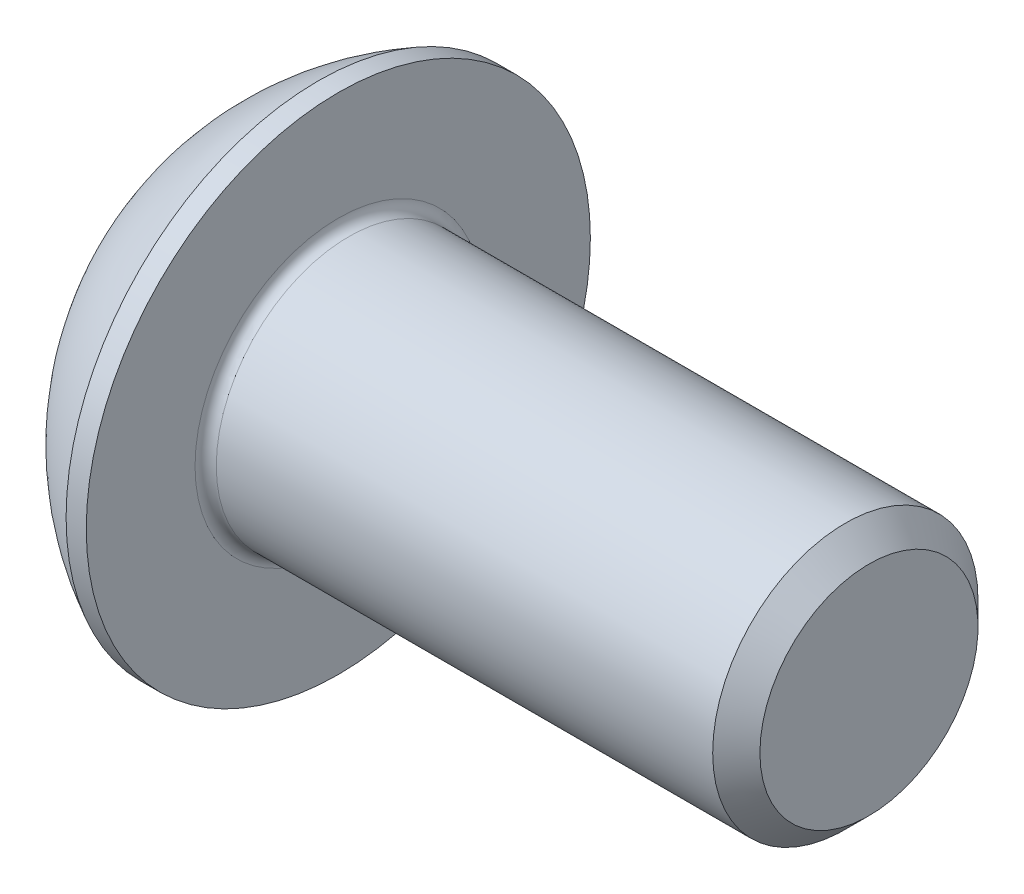
ISO-10303-21;
HEADER;
FILE_DESCRIPTION(('STEP AP214'),'2;1');
FILE_NAME('part.step','',(''),(''),'','','');
FILE_SCHEMA(('AUTOMOTIVE_DESIGN { 1 0 10303 214 1 1 1 1 }'));
ENDSEC;
DATA;
#1=APPLICATION_CONTEXT('core data for automotive mechanical design processes');
#2=APPLICATION_PROTOCOL_DEFINITION('international standard','automotive_design',2000,#1);
#3=PRODUCT_CONTEXT('',#1,'mechanical');
#4=PRODUCT('Part','Part','',(#3));
#5=PRODUCT_RELATED_PRODUCT_CATEGORY('part','',(#4));
#6=PRODUCT_DEFINITION_FORMATION('','',#4);
#7=PRODUCT_DEFINITION_CONTEXT('part definition',#1,'design');
#8=PRODUCT_DEFINITION('design','',#6,#7);
#9=PRODUCT_DEFINITION_SHAPE('','',#8);
#10=(LENGTH_UNIT() NAMED_UNIT(*) SI_UNIT(.MILLI.,.METRE.));
#11=(NAMED_UNIT(*) PLANE_ANGLE_UNIT() SI_UNIT($,.RADIAN.));
#12=(NAMED_UNIT(*) SI_UNIT($,.STERADIAN.) SOLID_ANGLE_UNIT());
#13=UNCERTAINTY_MEASURE_WITH_UNIT(LENGTH_MEASURE(1.E-05),#10,'distance_accuracy_value','');
#14=(GEOMETRIC_REPRESENTATION_CONTEXT(3) GLOBAL_UNCERTAINTY_ASSIGNED_CONTEXT((#13)) GLOBAL_UNIT_ASSIGNED_CONTEXT((#10,
#11,#12)) REPRESENTATION_CONTEXT('',''));
#15=CARTESIAN_POINT('',(0.,0.,0.));
#16=DIRECTION('',(0.,0.,1.));
#17=DIRECTION('',(1.,0.,0.));
#18=AXIS2_PLACEMENT_3D('',#15,#16,#17);
#19=CARTESIAN_POINT('',(0.,0.,0.));
#20=DIRECTION('',(-1.,0.,0.));
#21=DIRECTION('',(0.,0.,1.));
#22=AXIS2_PLACEMENT_3D('',#19,#20,#21);
#23=PLANE('',#22);
#24=CARTESIAN_POINT('',(0.,0.,0.));
#25=DIRECTION('',(-1.,0.,0.));
#26=DIRECTION('',(0.,0.,1.));
#27=AXIS2_PLACEMENT_3D('',#24,#25,#26);
#28=CIRCLE('',#27,2.375);
#29=CARTESIAN_POINT('',(0.,0.,2.375));
#30=VERTEX_POINT('',#29);
#31=EDGE_CURVE('E152',#30,#30,#28,.T.);
#32=ORIENTED_EDGE('',*,*,#31,.T.);
#33=EDGE_LOOP('',(#32));
#34=FACE_BOUND('',#33,.T.);
#35=DIRECTION('',(0.,-1.,0.));
#36=VECTOR('',#35,1.);
#37=CARTESIAN_POINT('',(0.,-0.866025403784438,1.5));
#38=LINE('',#37,#36);
#39=CARTESIAN_POINT('',(0.,0.86602540378444,1.5));
#40=VERTEX_POINT('',#39);
#41=CARTESIAN_POINT('',(0.,-0.866025403784438,1.5));
#42=VERTEX_POINT('',#41);
#43=EDGE_CURVE('E47',#40,#42,#38,.T.);
#44=ORIENTED_EDGE('',*,*,#43,.T.);
#45=DIRECTION('',(0.,-0.5,-0.866025403784439));
#46=VECTOR('',#45,1.);
#47=CARTESIAN_POINT('',(0.,-1.73205080756888,0.));
#48=LINE('',#47,#46);
#49=CARTESIAN_POINT('',(0.,-1.73205080756888,0.));
#50=VERTEX_POINT('',#49);
#51=EDGE_CURVE('E272',#42,#50,#48,.T.);
#52=ORIENTED_EDGE('',*,*,#51,.T.);
#53=DIRECTION('',(0.,0.5,-0.866025403784438));
#54=VECTOR('',#53,1.);
#55=CARTESIAN_POINT('',(0.,-0.866025403784438,-1.5));
#56=LINE('',#55,#54);
#57=CARTESIAN_POINT('',(0.,-0.866025403784438,-1.5));
#58=VERTEX_POINT('',#57);
#59=EDGE_CURVE('E127',#50,#58,#56,.T.);
#60=ORIENTED_EDGE('',*,*,#59,.T.);
#61=DIRECTION('',(0.,1.,0.));
#62=VECTOR('',#61,1.);
#63=CARTESIAN_POINT('',(0.,0.86602540378444,-1.5));
#64=LINE('',#63,#62);
#65=CARTESIAN_POINT('',(0.,0.86602540378444,-1.5));
#66=VERTEX_POINT('',#65);
#67=EDGE_CURVE('E275',#58,#66,#64,.T.);
#68=ORIENTED_EDGE('',*,*,#67,.T.);
#69=DIRECTION('',(0.,0.5,0.866025403784439));
#70=VECTOR('',#69,1.);
#71=CARTESIAN_POINT('',(0.,1.73205080756888,0.));
#72=LINE('',#71,#70);
#73=CARTESIAN_POINT('',(0.,1.73205080756888,0.));
#74=VERTEX_POINT('',#73);
#75=EDGE_CURVE('E277',#66,#74,#72,.T.);
#76=ORIENTED_EDGE('',*,*,#75,.T.);
#77=DIRECTION('',(0.,-0.5,0.866025403784439));
#78=VECTOR('',#77,1.);
#79=CARTESIAN_POINT('',(0.,0.86602540378444,1.5));
#80=LINE('',#79,#78);
#81=EDGE_CURVE('E279',#74,#40,#80,.T.);
#82=ORIENTED_EDGE('',*,*,#81,.T.);
#83=EDGE_LOOP('',(#44,#52,#60,#68,#76,#82));
#84=FACE_BOUND('',#83,.T.);
#85=ADVANCED_FACE('F32',(#34,#84),#23,.T.);
#86=CARTESIAN_POINT('',(4.75501582278481,0.,0.));
#87=DIRECTION('',(-1.,0.,0.));
#88=DIRECTION('',(0.,1.,0.));
#89=AXIS2_PLACEMENT_3D('',#86,#87,#88);
#90=SPHERICAL_SURFACE('',#89,5.3151482081814);
#91=CARTESIAN_POINT('',(2.37,0.,0.));
#92=DIRECTION('',(-1.,0.,0.));
#93=DIRECTION('',(0.,0.,1.));
#94=AXIS2_PLACEMENT_3D('',#91,#92,#93);
#95=CIRCLE('',#94,4.75);
#96=CARTESIAN_POINT('',(2.37,0.,4.75));
#97=VERTEX_POINT('',#96);
#98=EDGE_CURVE('E149',#97,#97,#95,.T.);
#99=ORIENTED_EDGE('',*,*,#98,.T.);
#100=EDGE_LOOP('',(#99));
#101=FACE_BOUND('',#100,.T.);
#102=ORIENTED_EDGE('',*,*,#31,.F.);
#103=EDGE_LOOP('',(#102));
#104=FACE_BOUND('',#103,.T.);
#105=ADVANCED_FACE('F173',(#101,#104),#90,.T.);
#106=CARTESIAN_POINT('',(0.,0.,0.));
#107=DIRECTION('',(-1.,0.,0.));
#108=DIRECTION('',(0.,0.,1.));
#109=AXIS2_PLACEMENT_3D('',#106,#107,#108);
#110=CYLINDRICAL_SURFACE('',#109,4.75);
#111=ORIENTED_EDGE('',*,*,#98,.F.);
#112=EDGE_LOOP('',(#111));
#113=FACE_BOUND('',#112,.T.);
#114=CARTESIAN_POINT('',(2.75,0.,0.));
#115=DIRECTION('',(-1.,0.,0.));
#116=DIRECTION('',(0.,0.,1.));
#117=AXIS2_PLACEMENT_3D('',#114,#115,#116);
#118=CIRCLE('',#117,4.75);
#119=CARTESIAN_POINT('',(2.75,0.,4.75));
#120=VERTEX_POINT('',#119);
#121=EDGE_CURVE('E146',#120,#120,#118,.T.);
#122=ORIENTED_EDGE('',*,*,#121,.T.);
#123=EDGE_LOOP('',(#122));
#124=FACE_BOUND('',#123,.T.);
#125=ADVANCED_FACE('F178',(#113,#124),#110,.T.);
#126=CARTESIAN_POINT('',(2.75,2.49999999999999,0.));
#127=DIRECTION('',(-1.,0.,0.));
#128=DIRECTION('',(0.,0.,1.));
#129=AXIS2_PLACEMENT_3D('',#126,#127,#128);
#130=PLANE('',#129);
#131=CARTESIAN_POINT('',(2.75,0.,0.));
#132=DIRECTION('',(-1.,0.,0.));
#133=DIRECTION('',(0.,0.,1.));
#134=AXIS2_PLACEMENT_3D('',#131,#132,#133);
#135=CIRCLE('',#134,2.69999999999999);
#136=CARTESIAN_POINT('',(2.75,0.,2.69999999999999));
#137=VERTEX_POINT('',#136);
#138=EDGE_CURVE('E40',#137,#137,#135,.T.);
#139=ORIENTED_EDGE('',*,*,#138,.T.);
#140=EDGE_LOOP('',(#139));
#141=FACE_BOUND('',#140,.T.);
#142=ORIENTED_EDGE('',*,*,#121,.F.);
#143=EDGE_LOOP('',(#142));
#144=FACE_BOUND('',#143,.T.);
#145=ADVANCED_FACE('F157',(#141,#144),#130,.F.);
#146=CARTESIAN_POINT('',(0.,0.,0.));
#147=DIRECTION('',(-1.,0.,0.));
#148=DIRECTION('',(0.,0.,1.));
#149=AXIS2_PLACEMENT_3D('',#146,#147,#148);
#150=CYLINDRICAL_SURFACE('',#149,2.49999999999999);
#151=CARTESIAN_POINT('',(2.95,0.,0.));
#152=DIRECTION('',(-1.,0.,0.));
#153=DIRECTION('',(0.,0.,1.));
#154=AXIS2_PLACEMENT_3D('',#151,#152,#153);
#155=CIRCLE('',#154,2.49999999999999);
#156=CARTESIAN_POINT('',(2.95,0.,2.49999999999999));
#157=VERTEX_POINT('',#156);
#158=EDGE_CURVE('E11',#157,#157,#155,.F.);
#159=ORIENTED_EDGE('',*,*,#158,.T.);
#160=EDGE_LOOP('',(#159));
#161=FACE_BOUND('',#160,.T.);
#162=CARTESIAN_POINT('',(12.305,0.,0.));
#163=DIRECTION('',(-1.,0.,0.));
#164=DIRECTION('',(0.,0.,1.));
#165=AXIS2_PLACEMENT_3D('',#162,#163,#164);
#166=CIRCLE('',#165,2.49999999999999);
#167=CARTESIAN_POINT('',(12.305,0.,2.49999999999999));
#168=VERTEX_POINT('',#167);
#169=EDGE_CURVE('E143',#168,#168,#166,.T.);
#170=ORIENTED_EDGE('',*,*,#169,.T.);
#171=EDGE_LOOP('',(#170));
#172=FACE_BOUND('',#171,.T.);
#173=ADVANCED_FACE('F187',(#161,#172),#150,.T.);
#174=CARTESIAN_POINT('',(12.75,0.,0.));
#175=DIRECTION('',(-1.,0.,0.));
#176=DIRECTION('',(0.,0.,1.));
#177=AXIS2_PLACEMENT_3D('',#174,#175,#176);
#178=CONICAL_SURFACE('',#177,2.055,0.785398163397474);
#179=ORIENTED_EDGE('',*,*,#169,.F.);
#180=EDGE_LOOP('',(#179));
#181=FACE_BOUND('',#180,.T.);
#182=CARTESIAN_POINT('',(12.75,0.,0.));
#183=DIRECTION('',(-1.,0.,0.));
#184=DIRECTION('',(0.,0.,1.));
#185=AXIS2_PLACEMENT_3D('',#182,#183,#184);
#186=CIRCLE('',#185,2.055);
#187=CARTESIAN_POINT('',(12.75,0.,2.055));
#188=VERTEX_POINT('',#187);
#189=EDGE_CURVE('E139',#188,#188,#186,.T.);
#190=ORIENTED_EDGE('',*,*,#189,.T.);
#191=EDGE_LOOP('',(#190));
#192=FACE_BOUND('',#191,.T.);
#193=ADVANCED_FACE('F168',(#181,#192),#178,.T.);
#194=CARTESIAN_POINT('',(12.75,0.,0.));
#195=DIRECTION('',(-1.,0.,0.));
#196=DIRECTION('',(0.,0.,1.));
#197=AXIS2_PLACEMENT_3D('',#194,#195,#196);
#198=PLANE('',#197);
#199=ORIENTED_EDGE('',*,*,#189,.F.);
#200=EDGE_LOOP('',(#199));
#201=FACE_BOUND('',#200,.T.);
#202=ADVANCED_FACE('F161',(#201),#198,.F.);
#203=CARTESIAN_POINT('',(2.95,0.,0.));
#204=DIRECTION('',(-1.,0.,0.));
#205=DIRECTION('',(0.,0.,1.));
#206=AXIS2_PLACEMENT_3D('',#203,#204,#205);
#207=TOROIDAL_SURFACE('',#206,2.69999999999999,0.2);
#208=ORIENTED_EDGE('',*,*,#158,.F.);
#209=EDGE_LOOP('',(#208));
#210=FACE_BOUND('',#209,.T.);
#211=ORIENTED_EDGE('',*,*,#138,.F.);
#212=EDGE_LOOP('',(#211));
#213=FACE_BOUND('',#212,.T.);
#214=ADVANCED_FACE('F34',(#210,#213),#207,.F.);
#215=CARTESIAN_POINT('',(1.56,-1.73205080756888,0.));
#216=DIRECTION('',(0.,0.866025403784438,-0.5));
#217=DIRECTION('',(0.,0.5,0.866025403784439));
#218=AXIS2_PLACEMENT_3D('',#215,#216,#217);
#219=PLANE('',#218);
#220=DIRECTION('',(0.,-0.5,-0.866025403784439));
#221=VECTOR('',#220,1.);
#222=CARTESIAN_POINT('',(1.56,-1.73205080756888,0.));
#223=LINE('',#222,#221);
#224=CARTESIAN_POINT('',(1.56,-0.866025403784438,1.5));
#225=VERTEX_POINT('',#224);
#226=CARTESIAN_POINT('',(1.56,-1.29903810567666,0.75));
#227=VERTEX_POINT('',#226);
#228=EDGE_CURVE('E113',#225,#227,#223,.T.);
#229=ORIENTED_EDGE('',*,*,#228,.T.);
#230=CARTESIAN_POINT('',(1.56,-1.73205080756888,0.));
#231=VERTEX_POINT('',#230);
#232=EDGE_CURVE('E108',#227,#231,#223,.T.);
#233=ORIENTED_EDGE('',*,*,#232,.T.);
#234=DIRECTION('',(-1.,0.,0.));
#235=VECTOR('',#234,1.);
#236=CARTESIAN_POINT('',(1.56,-1.73205080756888,0.));
#237=LINE('',#236,#235);
#238=EDGE_CURVE('E110',#231,#50,#237,.T.);
#239=ORIENTED_EDGE('',*,*,#238,.T.);
#240=ORIENTED_EDGE('',*,*,#51,.F.);
#241=DIRECTION('',(-1.,0.,0.));
#242=VECTOR('',#241,1.);
#243=CARTESIAN_POINT('',(1.56,-0.866025403784438,1.5));
#244=LINE('',#243,#242);
#245=EDGE_CURVE('E268',#225,#42,#244,.T.);
#246=ORIENTED_EDGE('',*,*,#245,.F.);
#247=EDGE_LOOP('',(#229,#233,#239,#240,#246));
#248=FACE_BOUND('',#247,.T.);
#249=ADVANCED_FACE('F109',(#248),#219,.T.);
#250=CARTESIAN_POINT('',(1.56,-0.866025403784438,-1.5));
#251=DIRECTION('',(0.,0.866025403784438,0.5));
#252=DIRECTION('',(0.,-0.5,0.866025403784439));
#253=AXIS2_PLACEMENT_3D('',#250,#251,#252);
#254=PLANE('',#253);
#255=DIRECTION('',(0.,0.5,-0.866025403784438));
#256=VECTOR('',#255,1.);
#257=CARTESIAN_POINT('',(1.56,-0.866025403784438,-1.5));
#258=LINE('',#257,#256);
#259=CARTESIAN_POINT('',(1.56,-1.29903810567666,-0.75));
#260=VERTEX_POINT('',#259);
#261=EDGE_CURVE('E55',#231,#260,#258,.T.);
#262=ORIENTED_EDGE('',*,*,#261,.T.);
#263=CARTESIAN_POINT('',(1.56,-0.866025403784438,-1.5));
#264=VERTEX_POINT('',#263);
#265=EDGE_CURVE('E122',#260,#264,#258,.T.);
#266=ORIENTED_EDGE('',*,*,#265,.T.);
#267=DIRECTION('',(-1.,0.,0.));
#268=VECTOR('',#267,1.);
#269=CARTESIAN_POINT('',(1.56,-0.866025403784438,-1.5));
#270=LINE('',#269,#268);
#271=EDGE_CURVE('E129',#264,#58,#270,.T.);
#272=ORIENTED_EDGE('',*,*,#271,.T.);
#273=ORIENTED_EDGE('',*,*,#59,.F.);
#274=ORIENTED_EDGE('',*,*,#238,.F.);
#275=EDGE_LOOP('',(#262,#266,#272,#273,#274));
#276=FACE_BOUND('',#275,.T.);
#277=ADVANCED_FACE('F125',(#276),#254,.T.);
#278=CARTESIAN_POINT('',(1.56,0.86602540378444,-1.5));
#279=DIRECTION('',(0.,0.,1.));
#280=DIRECTION('',(1.,0.,0.));
#281=AXIS2_PLACEMENT_3D('',#278,#279,#280);
#282=PLANE('',#281);
#283=DIRECTION('',(0.,1.,0.));
#284=VECTOR('',#283,1.);
#285=CARTESIAN_POINT('',(1.56,0.86602540378444,-1.5));
#286=LINE('',#285,#284);
#287=CARTESIAN_POINT('',(1.56,0.,-1.5));
#288=VERTEX_POINT('',#287);
#289=EDGE_CURVE('E249',#264,#288,#286,.T.);
#290=ORIENTED_EDGE('',*,*,#289,.T.);
#291=CARTESIAN_POINT('',(1.56,0.86602540378444,-1.5));
#292=VERTEX_POINT('',#291);
#293=EDGE_CURVE('E121',#288,#292,#286,.T.);
#294=ORIENTED_EDGE('',*,*,#293,.T.);
#295=DIRECTION('',(-1.,0.,0.));
#296=VECTOR('',#295,1.);
#297=CARTESIAN_POINT('',(1.56,0.86602540378444,-1.5));
#298=LINE('',#297,#296);
#299=EDGE_CURVE('E134',#292,#66,#298,.T.);
#300=ORIENTED_EDGE('',*,*,#299,.T.);
#301=ORIENTED_EDGE('',*,*,#67,.F.);
#302=ORIENTED_EDGE('',*,*,#271,.F.);
#303=EDGE_LOOP('',(#290,#294,#300,#301,#302));
#304=FACE_BOUND('',#303,.T.);
#305=ADVANCED_FACE('F201',(#304),#282,.T.);
#306=CARTESIAN_POINT('',(1.56,1.73205080756888,0.));
#307=DIRECTION('',(0.,-0.866025403784439,0.5));
#308=DIRECTION('',(0.,-0.5,-0.866025403784439));
#309=AXIS2_PLACEMENT_3D('',#306,#307,#308);
#310=PLANE('',#309);
#311=DIRECTION('',(0.,0.5,0.866025403784439));
#312=VECTOR('',#311,1.);
#313=CARTESIAN_POINT('',(1.56,1.73205080756888,0.));
#314=LINE('',#313,#312);
#315=CARTESIAN_POINT('',(1.56,1.29903810567666,-0.750000000000001));
#316=VERTEX_POINT('',#315);
#317=EDGE_CURVE('E238',#292,#316,#314,.T.);
#318=ORIENTED_EDGE('',*,*,#317,.T.);
#319=CARTESIAN_POINT('',(1.56,1.73205080756888,0.));
#320=VERTEX_POINT('',#319);
#321=EDGE_CURVE('E243',#316,#320,#314,.T.);
#322=ORIENTED_EDGE('',*,*,#321,.T.);
#323=DIRECTION('',(-1.,0.,0.));
#324=VECTOR('',#323,1.);
#325=CARTESIAN_POINT('',(1.56,1.73205080756888,0.));
#326=LINE('',#325,#324);
#327=EDGE_CURVE('E283',#320,#74,#326,.T.);
#328=ORIENTED_EDGE('',*,*,#327,.T.);
#329=ORIENTED_EDGE('',*,*,#75,.F.);
#330=ORIENTED_EDGE('',*,*,#299,.F.);
#331=EDGE_LOOP('',(#318,#322,#328,#329,#330));
#332=FACE_BOUND('',#331,.T.);
#333=ADVANCED_FACE('F204',(#332),#310,.T.);
#334=CARTESIAN_POINT('',(1.56,0.86602540378444,1.5));
#335=DIRECTION('',(0.,-0.866025403784439,-0.5));
#336=DIRECTION('',(0.,0.5,-0.866025403784439));
#337=AXIS2_PLACEMENT_3D('',#334,#335,#336);
#338=PLANE('',#337);
#339=DIRECTION('',(0.,-0.5,0.866025403784439));
#340=VECTOR('',#339,1.);
#341=CARTESIAN_POINT('',(1.56,0.86602540378444,1.5));
#342=LINE('',#341,#340);
#343=CARTESIAN_POINT('',(1.56,1.29903810567666,0.75));
#344=VERTEX_POINT('',#343);
#345=EDGE_CURVE('E246',#320,#344,#342,.T.);
#346=ORIENTED_EDGE('',*,*,#345,.T.);
#347=CARTESIAN_POINT('',(1.56,0.86602540378444,1.5));
#348=VERTEX_POINT('',#347);
#349=EDGE_CURVE('E254',#344,#348,#342,.T.);
#350=ORIENTED_EDGE('',*,*,#349,.T.);
#351=DIRECTION('',(-1.,0.,0.));
#352=VECTOR('',#351,1.);
#353=CARTESIAN_POINT('',(1.56,0.86602540378444,1.5));
#354=LINE('',#353,#352);
#355=EDGE_CURVE('E267',#348,#40,#354,.T.);
#356=ORIENTED_EDGE('',*,*,#355,.T.);
#357=ORIENTED_EDGE('',*,*,#81,.F.);
#358=ORIENTED_EDGE('',*,*,#327,.F.);
#359=EDGE_LOOP('',(#346,#350,#356,#357,#358));
#360=FACE_BOUND('',#359,.T.);
#361=ADVANCED_FACE('F208',(#360),#338,.T.);
#362=CARTESIAN_POINT('',(1.56,-0.866025403784438,1.5));
#363=DIRECTION('',(0.,0.,-1.));
#364=DIRECTION('',(0.,1.,0.));
#365=AXIS2_PLACEMENT_3D('',#362,#363,#364);
#366=PLANE('',#365);
#367=DIRECTION('',(0.,-1.,0.));
#368=VECTOR('',#367,1.);
#369=CARTESIAN_POINT('',(1.56,-0.866025403784438,1.5));
#370=LINE('',#369,#368);
#371=CARTESIAN_POINT('',(1.56,0.,1.5));
#372=VERTEX_POINT('',#371);
#373=EDGE_CURVE('E260',#348,#372,#370,.T.);
#374=ORIENTED_EDGE('',*,*,#373,.T.);
#375=EDGE_CURVE('E262',#372,#225,#370,.T.);
#376=ORIENTED_EDGE('',*,*,#375,.T.);
#377=ORIENTED_EDGE('',*,*,#245,.T.);
#378=ORIENTED_EDGE('',*,*,#43,.F.);
#379=ORIENTED_EDGE('',*,*,#355,.F.);
#380=EDGE_LOOP('',(#374,#376,#377,#378,#379));
#381=FACE_BOUND('',#380,.T.);
#382=ADVANCED_FACE('F212',(#381),#366,.T.);
#383=CARTESIAN_POINT('',(1.56,-1.73205080756888,0.));
#384=DIRECTION('',(1.,0.,0.));
#385=DIRECTION('',(0.,0.,-1.));
#386=AXIS2_PLACEMENT_3D('',#383,#384,#385);
#387=PLANE('',#386);
#388=CARTESIAN_POINT('',(1.56,0.,0.));
#389=DIRECTION('',(-1.,0.,0.));
#390=DIRECTION('',(0.,0.,1.));
#391=AXIS2_PLACEMENT_3D('',#388,#389,#390);
#392=CIRCLE('',#391,1.5);
#393=EDGE_CURVE('E235',#316,#288,#392,.T.);
#394=ORIENTED_EDGE('',*,*,#393,.F.);
#395=ORIENTED_EDGE('',*,*,#317,.F.);
#396=ORIENTED_EDGE('',*,*,#293,.F.);
#397=EDGE_LOOP('',(#394,#395,#396));
#398=FACE_BOUND('',#397,.T.);
#399=ADVANCED_FACE('F216',(#398),#387,.F.);
#400=EDGE_CURVE('E140',#344,#316,#392,.T.);
#401=ORIENTED_EDGE('',*,*,#400,.F.);
#402=ORIENTED_EDGE('',*,*,#345,.F.);
#403=ORIENTED_EDGE('',*,*,#321,.F.);
#404=EDGE_LOOP('',(#401,#402,#403));
#405=FACE_BOUND('',#404,.T.);
#406=ADVANCED_FACE('F225',(#405),#387,.F.);
#407=EDGE_CURVE('E133',#372,#344,#392,.T.);
#408=ORIENTED_EDGE('',*,*,#407,.F.);
#409=ORIENTED_EDGE('',*,*,#373,.F.);
#410=ORIENTED_EDGE('',*,*,#349,.F.);
#411=EDGE_LOOP('',(#408,#409,#410));
#412=FACE_BOUND('',#411,.T.);
#413=ADVANCED_FACE('F230',(#412),#387,.F.);
#414=EDGE_CURVE('E128',#227,#372,#392,.T.);
#415=ORIENTED_EDGE('',*,*,#414,.F.);
#416=ORIENTED_EDGE('',*,*,#228,.F.);
#417=ORIENTED_EDGE('',*,*,#375,.F.);
#418=EDGE_LOOP('',(#415,#416,#417));
#419=FACE_BOUND('',#418,.T.);
#420=ADVANCED_FACE('F223',(#419),#387,.F.);
#421=EDGE_CURVE('E119',#260,#227,#392,.T.);
#422=ORIENTED_EDGE('',*,*,#421,.F.);
#423=ORIENTED_EDGE('',*,*,#261,.F.);
#424=ORIENTED_EDGE('',*,*,#232,.F.);
#425=EDGE_LOOP('',(#422,#423,#424));
#426=FACE_BOUND('',#425,.T.);
#427=ADVANCED_FACE('F118',(#426),#387,.F.);
#428=EDGE_CURVE('E241',#288,#260,#392,.T.);
#429=ORIENTED_EDGE('',*,*,#428,.F.);
#430=ORIENTED_EDGE('',*,*,#289,.F.);
#431=ORIENTED_EDGE('',*,*,#265,.F.);
#432=EDGE_LOOP('',(#429,#430,#431));
#433=FACE_BOUND('',#432,.T.);
#434=ADVANCED_FACE('F196',(#433),#387,.F.);
#435=CARTESIAN_POINT('',(2.42602540378445,0.,0.));
#436=DIRECTION('',(-1.,0.,0.));
#437=DIRECTION('',(0.,0.,1.));
#438=AXIS2_PLACEMENT_3D('',#435,#436,#437);
#439=CONICAL_SURFACE('',#438,0.,1.04719755119659);
#440=ORIENTED_EDGE('',*,*,#407,.T.);
#441=ORIENTED_EDGE('',*,*,#400,.T.);
#442=ORIENTED_EDGE('',*,*,#393,.T.);
#443=ORIENTED_EDGE('',*,*,#428,.T.);
#444=ORIENTED_EDGE('',*,*,#421,.T.);
#445=ORIENTED_EDGE('',*,*,#414,.T.);
#446=EDGE_LOOP('',(#440,#441,#442,#443,#444,#445));
#447=FACE_BOUND('',#446,.T.);
#448=CARTESIAN_POINT('',(2.42602540378445,0.,0.));
#449=VERTEX_POINT('',#448);
#450=VERTEX_LOOP('',#449);
#451=FACE_BOUND('',#450,.T.);
#452=ADVANCED_FACE('F194',(#447,#451),#439,.F.);
#453=CLOSED_SHELL('',(#85,#105,#125,#145,#173,#193,#202,#214,#249,#277,#305,#333,#361,#382,#399,
#406,#413,#420,#427,#434,#452));
#454=MANIFOLD_SOLID_BREP('B2',#453);
#455=ADVANCED_BREP_SHAPE_REPRESENTATION('',(#18,#454),#14);
#456=SHAPE_DEFINITION_REPRESENTATION(#9,#455);
ENDSEC;
END-ISO-10303-21;
